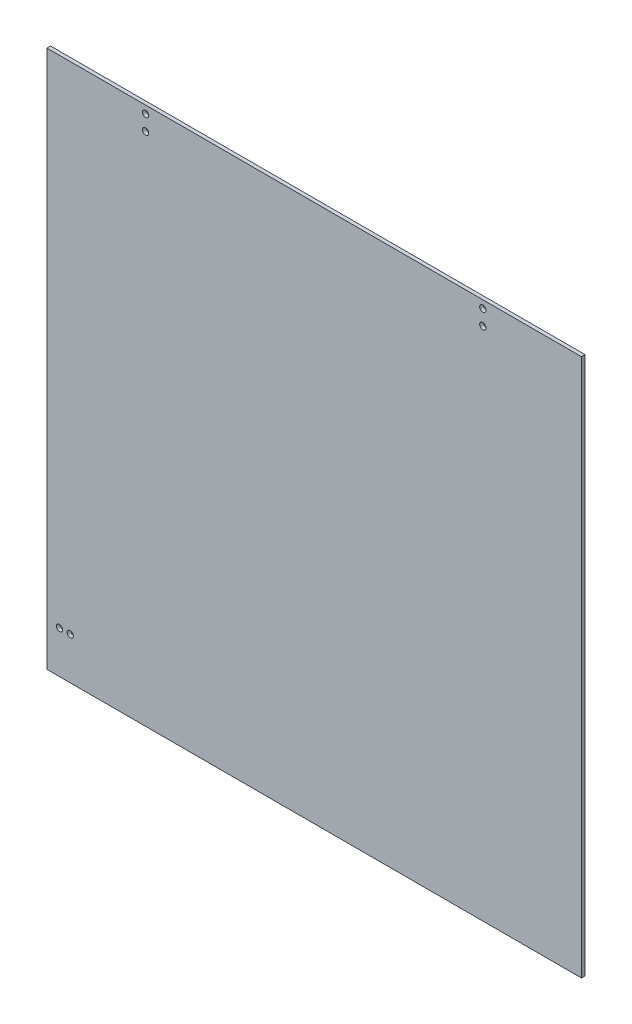
ISO-10303-21;
HEADER;
FILE_DESCRIPTION(('STEP AP214'),'2;1');
FILE_NAME('part.step','',(''),(''),'','','');
FILE_SCHEMA(('AUTOMOTIVE_DESIGN { 1 0 10303 214 1 1 1 1 }'));
ENDSEC;
DATA;
#1=APPLICATION_CONTEXT('core data for automotive mechanical design processes');
#2=APPLICATION_PROTOCOL_DEFINITION('international standard','automotive_design',2000,#1);
#3=PRODUCT_CONTEXT('',#1,'mechanical');
#4=PRODUCT('Part','Part','',(#3));
#5=PRODUCT_RELATED_PRODUCT_CATEGORY('part','',(#4));
#6=PRODUCT_DEFINITION_FORMATION('','',#4);
#7=PRODUCT_DEFINITION_CONTEXT('part definition',#1,'design');
#8=PRODUCT_DEFINITION('design','',#6,#7);
#9=PRODUCT_DEFINITION_SHAPE('','',#8);
#10=(LENGTH_UNIT() NAMED_UNIT(*) SI_UNIT(.MILLI.,.METRE.));
#11=(NAMED_UNIT(*) PLANE_ANGLE_UNIT() SI_UNIT($,.RADIAN.));
#12=(NAMED_UNIT(*) SI_UNIT($,.STERADIAN.) SOLID_ANGLE_UNIT());
#13=UNCERTAINTY_MEASURE_WITH_UNIT(LENGTH_MEASURE(1.E-05),#10,'distance_accuracy_value','');
#14=(GEOMETRIC_REPRESENTATION_CONTEXT(3) GLOBAL_UNCERTAINTY_ASSIGNED_CONTEXT((#13)) GLOBAL_UNIT_ASSIGNED_CONTEXT((#10,
#11,#12)) REPRESENTATION_CONTEXT('',''));
#15=CARTESIAN_POINT('',(0.,0.,0.));
#16=DIRECTION('',(0.,0.,1.));
#17=DIRECTION('',(1.,0.,0.));
#18=AXIS2_PLACEMENT_3D('',#15,#16,#17);
#19=CARTESIAN_POINT('',(0.,0.,2.));
#20=DIRECTION('',(1.,0.,0.));
#21=DIRECTION('',(0.,0.,-1.));
#22=AXIS2_PLACEMENT_3D('',#19,#20,#21);
#23=PLANE('',#22);
#24=DIRECTION('',(0.,-1.,0.));
#25=VECTOR('',#24,1.);
#26=CARTESIAN_POINT('',(0.,0.,0.));
#27=LINE('',#26,#25);
#28=CARTESIAN_POINT('',(0.,300.,0.));
#29=VERTEX_POINT('',#28);
#30=CARTESIAN_POINT('',(0.,0.,0.));
#31=VERTEX_POINT('',#30);
#32=EDGE_CURVE('E98',#29,#31,#27,.T.);
#33=ORIENTED_EDGE('',*,*,#32,.T.);
#34=DIRECTION('',(0.,0.,-1.));
#35=VECTOR('',#34,1.);
#36=CARTESIAN_POINT('',(0.,0.,2.));
#37=LINE('',#36,#35);
#38=CARTESIAN_POINT('',(0.,0.,2.));
#39=VERTEX_POINT('',#38);
#40=EDGE_CURVE('E11',#39,#31,#37,.T.);
#41=ORIENTED_EDGE('',*,*,#40,.F.);
#42=DIRECTION('',(0.,-1.,0.));
#43=VECTOR('',#42,1.);
#44=CARTESIAN_POINT('',(0.,0.,2.));
#45=LINE('',#44,#43);
#46=CARTESIAN_POINT('',(0.,300.,2.));
#47=VERTEX_POINT('',#46);
#48=EDGE_CURVE('E85',#47,#39,#45,.T.);
#49=ORIENTED_EDGE('',*,*,#48,.F.);
#50=DIRECTION('',(0.,0.,-1.));
#51=VECTOR('',#50,1.);
#52=CARTESIAN_POINT('',(0.,300.,2.));
#53=LINE('',#52,#51);
#54=EDGE_CURVE('E94',#47,#29,#53,.T.);
#55=ORIENTED_EDGE('',*,*,#54,.T.);
#56=EDGE_LOOP('',(#33,#41,#49,#55));
#57=FACE_BOUND('',#56,.T.);
#58=ADVANCED_FACE('F32',(#57),#23,.F.);
#59=CARTESIAN_POINT('',(0.,0.,2.));
#60=DIRECTION('',(0.,1.,0.));
#61=DIRECTION('',(0.,0.,1.));
#62=AXIS2_PLACEMENT_3D('',#59,#60,#61);
#63=PLANE('',#62);
#64=DIRECTION('',(1.,0.,0.));
#65=VECTOR('',#64,1.);
#66=CARTESIAN_POINT('',(0.,0.,0.));
#67=LINE('',#66,#65);
#68=CARTESIAN_POINT('',(298.,0.,0.));
#69=VERTEX_POINT('',#68);
#70=EDGE_CURVE('E89',#31,#69,#67,.T.);
#71=ORIENTED_EDGE('',*,*,#70,.T.);
#72=DIRECTION('',(0.,0.,-1.));
#73=VECTOR('',#72,1.);
#74=CARTESIAN_POINT('',(298.,0.,2.));
#75=LINE('',#74,#73);
#76=CARTESIAN_POINT('',(298.,0.,2.));
#77=VERTEX_POINT('',#76);
#78=EDGE_CURVE('E41',#77,#69,#75,.T.);
#79=ORIENTED_EDGE('',*,*,#78,.F.);
#80=DIRECTION('',(1.,0.,0.));
#81=VECTOR('',#80,1.);
#82=CARTESIAN_POINT('',(0.,0.,2.));
#83=LINE('',#82,#81);
#84=EDGE_CURVE('E80',#39,#77,#83,.T.);
#85=ORIENTED_EDGE('',*,*,#84,.F.);
#86=ORIENTED_EDGE('',*,*,#40,.T.);
#87=EDGE_LOOP('',(#71,#79,#85,#86));
#88=FACE_BOUND('',#87,.T.);
#89=ADVANCED_FACE('F88',(#88),#63,.F.);
#90=CARTESIAN_POINT('',(298.,0.,2.));
#91=DIRECTION('',(-1.,0.,0.));
#92=DIRECTION('',(0.,0.,1.));
#93=AXIS2_PLACEMENT_3D('',#90,#91,#92);
#94=PLANE('',#93);
#95=DIRECTION('',(0.,1.,0.));
#96=VECTOR('',#95,1.);
#97=CARTESIAN_POINT('',(298.,0.,0.));
#98=LINE('',#97,#96);
#99=CARTESIAN_POINT('',(298.,300.,0.));
#100=VERTEX_POINT('',#99);
#101=EDGE_CURVE('E67',#69,#100,#98,.T.);
#102=ORIENTED_EDGE('',*,*,#101,.T.);
#103=DIRECTION('',(0.,0.,-1.));
#104=VECTOR('',#103,1.);
#105=CARTESIAN_POINT('',(298.,300.,2.));
#106=LINE('',#105,#104);
#107=CARTESIAN_POINT('',(298.,300.,2.));
#108=VERTEX_POINT('',#107);
#109=EDGE_CURVE('E90',#108,#100,#106,.T.);
#110=ORIENTED_EDGE('',*,*,#109,.F.);
#111=DIRECTION('',(0.,1.,0.));
#112=VECTOR('',#111,1.);
#113=CARTESIAN_POINT('',(298.,0.,2.));
#114=LINE('',#113,#112);
#115=EDGE_CURVE('E83',#77,#108,#114,.T.);
#116=ORIENTED_EDGE('',*,*,#115,.F.);
#117=ORIENTED_EDGE('',*,*,#78,.T.);
#118=EDGE_LOOP('',(#102,#110,#116,#117));
#119=FACE_BOUND('',#118,.T.);
#120=ADVANCED_FACE('F92',(#119),#94,.F.);
#121=CARTESIAN_POINT('',(0.,300.,2.));
#122=DIRECTION('',(0.,-1.,0.));
#123=DIRECTION('',(0.,0.,-1.));
#124=AXIS2_PLACEMENT_3D('',#121,#122,#123);
#125=PLANE('',#124);
#126=DIRECTION('',(-1.,0.,0.));
#127=VECTOR('',#126,1.);
#128=CARTESIAN_POINT('',(0.,300.,0.));
#129=LINE('',#128,#127);
#130=EDGE_CURVE('E73',#100,#29,#129,.T.);
#131=ORIENTED_EDGE('',*,*,#130,.T.);
#132=ORIENTED_EDGE('',*,*,#54,.F.);
#133=DIRECTION('',(-1.,0.,0.));
#134=VECTOR('',#133,1.);
#135=CARTESIAN_POINT('',(0.,300.,2.));
#136=LINE('',#135,#134);
#137=EDGE_CURVE('E50',#108,#47,#136,.T.);
#138=ORIENTED_EDGE('',*,*,#137,.F.);
#139=ORIENTED_EDGE('',*,*,#109,.T.);
#140=EDGE_LOOP('',(#131,#132,#138,#139));
#141=FACE_BOUND('',#140,.T.);
#142=ADVANCED_FACE('F156',(#141),#125,.F.);
#143=CARTESIAN_POINT('',(0.,0.,2.));
#144=DIRECTION('',(0.,0.,-1.));
#145=DIRECTION('',(-1.,0.,0.));
#146=AXIS2_PLACEMENT_3D('',#143,#144,#145);
#147=PLANE('',#146);
#148=CARTESIAN_POINT('',(13.0000000000001,23.4999999999999,2.));
#149=DIRECTION('',(0.,0.,1.));
#150=DIRECTION('',(1.,0.,0.));
#151=AXIS2_PLACEMENT_3D('',#148,#149,#150);
#152=CIRCLE('',#151,1.75);
#153=CARTESIAN_POINT('',(14.7500000000001,23.4999999999999,2.));
#154=VERTEX_POINT('',#153);
#155=EDGE_CURVE('E138',#154,#154,#152,.T.);
#156=ORIENTED_EDGE('',*,*,#155,.F.);
#157=EDGE_LOOP('',(#156));
#158=FACE_BOUND('',#157,.T.);
#159=CARTESIAN_POINT('',(7.0000000000001,23.4999999999999,2.));
#160=DIRECTION('',(0.,0.,1.));
#161=DIRECTION('',(1.,0.,0.));
#162=AXIS2_PLACEMENT_3D('',#159,#160,#161);
#163=CIRCLE('',#162,1.75);
#164=CARTESIAN_POINT('',(8.7500000000001,23.4999999999999,2.));
#165=VERTEX_POINT('',#164);
#166=EDGE_CURVE('E132',#165,#165,#163,.T.);
#167=ORIENTED_EDGE('',*,*,#166,.F.);
#168=EDGE_LOOP('',(#167));
#169=FACE_BOUND('',#168,.T.);
#170=CARTESIAN_POINT('',(55.,295.75,2.));
#171=DIRECTION('',(0.,0.,-1.));
#172=DIRECTION('',(-1.,0.,0.));
#173=AXIS2_PLACEMENT_3D('',#170,#171,#172);
#174=CIRCLE('',#173,1.75);
#175=CARTESIAN_POINT('',(53.25,295.75,2.));
#176=VERTEX_POINT('',#175);
#177=EDGE_CURVE('E125',#176,#176,#174,.T.);
#178=ORIENTED_EDGE('',*,*,#177,.T.);
#179=EDGE_LOOP('',(#178));
#180=FACE_BOUND('',#179,.T.);
#181=CARTESIAN_POINT('',(55.,287.25,2.));
#182=DIRECTION('',(0.,0.,-1.));
#183=DIRECTION('',(-1.,0.,0.));
#184=AXIS2_PLACEMENT_3D('',#181,#182,#183);
#185=CIRCLE('',#184,1.75);
#186=CARTESIAN_POINT('',(53.25,287.25,2.));
#187=VERTEX_POINT('',#186);
#188=EDGE_CURVE('E119',#187,#187,#185,.T.);
#189=ORIENTED_EDGE('',*,*,#188,.T.);
#190=EDGE_LOOP('',(#189));
#191=FACE_BOUND('',#190,.T.);
#192=CARTESIAN_POINT('',(243.,287.25,2.));
#193=DIRECTION('',(0.,0.,1.));
#194=DIRECTION('',(1.,0.,0.));
#195=AXIS2_PLACEMENT_3D('',#192,#193,#194);
#196=CIRCLE('',#195,1.74999999999996);
#197=CARTESIAN_POINT('',(244.75,287.25,2.));
#198=VERTEX_POINT('',#197);
#199=EDGE_CURVE('E115',#198,#198,#196,.T.);
#200=ORIENTED_EDGE('',*,*,#199,.F.);
#201=EDGE_LOOP('',(#200));
#202=FACE_BOUND('',#201,.T.);
#203=CARTESIAN_POINT('',(243.,295.75,2.));
#204=DIRECTION('',(0.,0.,1.));
#205=DIRECTION('',(1.,0.,0.));
#206=AXIS2_PLACEMENT_3D('',#203,#204,#205);
#207=CIRCLE('',#206,1.74999999999996);
#208=CARTESIAN_POINT('',(244.75,295.75,2.));
#209=VERTEX_POINT('',#208);
#210=EDGE_CURVE('E107',#209,#209,#207,.T.);
#211=ORIENTED_EDGE('',*,*,#210,.F.);
#212=EDGE_LOOP('',(#211));
#213=FACE_BOUND('',#212,.T.);
#214=ORIENTED_EDGE('',*,*,#48,.T.);
#215=ORIENTED_EDGE('',*,*,#84,.T.);
#216=ORIENTED_EDGE('',*,*,#115,.T.);
#217=ORIENTED_EDGE('',*,*,#137,.T.);
#218=EDGE_LOOP('',(#214,#215,#216,#217));
#219=FACE_BOUND('',#218,.T.);
#220=ADVANCED_FACE('F81',(#158,#169,#180,#191,#202,#213,#219),#147,.F.);
#221=CARTESIAN_POINT('',(0.,0.,0.));
#222=DIRECTION('',(0.,0.,-1.));
#223=DIRECTION('',(-1.,0.,0.));
#224=AXIS2_PLACEMENT_3D('',#221,#222,#223);
#225=PLANE('',#224);
#226=CARTESIAN_POINT('',(13.0000000000001,23.4999999999999,0.));
#227=DIRECTION('',(0.,0.,1.));
#228=DIRECTION('',(1.,0.,0.));
#229=AXIS2_PLACEMENT_3D('',#226,#227,#228);
#230=CIRCLE('',#229,1.75);
#231=CARTESIAN_POINT('',(14.7500000000001,23.4999999999999,0.));
#232=VERTEX_POINT('',#231);
#233=EDGE_CURVE('E135',#232,#232,#230,.T.);
#234=ORIENTED_EDGE('',*,*,#233,.T.);
#235=EDGE_LOOP('',(#234));
#236=FACE_BOUND('',#235,.T.);
#237=CARTESIAN_POINT('',(7.0000000000001,23.4999999999999,0.));
#238=DIRECTION('',(0.,0.,1.));
#239=DIRECTION('',(1.,0.,0.));
#240=AXIS2_PLACEMENT_3D('',#237,#238,#239);
#241=CIRCLE('',#240,1.75);
#242=CARTESIAN_POINT('',(8.7500000000001,23.4999999999999,0.));
#243=VERTEX_POINT('',#242);
#244=EDGE_CURVE('E131',#243,#243,#241,.T.);
#245=ORIENTED_EDGE('',*,*,#244,.T.);
#246=EDGE_LOOP('',(#245));
#247=FACE_BOUND('',#246,.T.);
#248=CARTESIAN_POINT('',(55.,295.75,0.));
#249=DIRECTION('',(0.,0.,1.));
#250=DIRECTION('',(1.,0.,0.));
#251=AXIS2_PLACEMENT_3D('',#248,#249,#250);
#252=CIRCLE('',#251,1.75);
#253=CARTESIAN_POINT('',(56.75,295.75,0.));
#254=VERTEX_POINT('',#253);
#255=EDGE_CURVE('E128',#254,#254,#252,.T.);
#256=ORIENTED_EDGE('',*,*,#255,.T.);
#257=EDGE_LOOP('',(#256));
#258=FACE_BOUND('',#257,.T.);
#259=CARTESIAN_POINT('',(55.,287.25,0.));
#260=DIRECTION('',(0.,0.,1.));
#261=DIRECTION('',(1.,0.,0.));
#262=AXIS2_PLACEMENT_3D('',#259,#260,#261);
#263=CIRCLE('',#262,1.75);
#264=CARTESIAN_POINT('',(56.75,287.25,0.));
#265=VERTEX_POINT('',#264);
#266=EDGE_CURVE('E122',#265,#265,#263,.T.);
#267=ORIENTED_EDGE('',*,*,#266,.T.);
#268=EDGE_LOOP('',(#267));
#269=FACE_BOUND('',#268,.T.);
#270=CARTESIAN_POINT('',(243.,287.25,0.));
#271=DIRECTION('',(0.,0.,-1.));
#272=DIRECTION('',(-1.,0.,0.));
#273=AXIS2_PLACEMENT_3D('',#270,#271,#272);
#274=CIRCLE('',#273,1.74999999999996);
#275=CARTESIAN_POINT('',(241.25,287.25,0.));
#276=VERTEX_POINT('',#275);
#277=EDGE_CURVE('E35',#276,#276,#274,.T.);
#278=ORIENTED_EDGE('',*,*,#277,.F.);
#279=EDGE_LOOP('',(#278));
#280=FACE_BOUND('',#279,.T.);
#281=CARTESIAN_POINT('',(243.,295.75,0.));
#282=DIRECTION('',(0.,0.,-1.));
#283=DIRECTION('',(-1.,0.,0.));
#284=AXIS2_PLACEMENT_3D('',#281,#282,#283);
#285=CIRCLE('',#284,1.74999999999996);
#286=CARTESIAN_POINT('',(241.25,295.75,0.));
#287=VERTEX_POINT('',#286);
#288=EDGE_CURVE('E101',#287,#287,#285,.T.);
#289=ORIENTED_EDGE('',*,*,#288,.F.);
#290=EDGE_LOOP('',(#289));
#291=FACE_BOUND('',#290,.T.);
#292=ORIENTED_EDGE('',*,*,#32,.F.);
#293=ORIENTED_EDGE('',*,*,#130,.F.);
#294=ORIENTED_EDGE('',*,*,#101,.F.);
#295=ORIENTED_EDGE('',*,*,#70,.F.);
#296=EDGE_LOOP('',(#292,#293,#294,#295));
#297=FACE_BOUND('',#296,.T.);
#298=ADVANCED_FACE('F144',(#236,#247,#258,#269,#280,#291,#297),#225,.T.);
#299=CARTESIAN_POINT('',(243.,295.75,-18.));
#300=DIRECTION('',(0.,0.,1.));
#301=DIRECTION('',(1.,0.,0.));
#302=AXIS2_PLACEMENT_3D('',#299,#300,#301);
#303=CYLINDRICAL_SURFACE('',#302,1.74999999999996);
#304=ORIENTED_EDGE('',*,*,#288,.T.);
#305=EDGE_LOOP('',(#304));
#306=FACE_BOUND('',#305,.T.);
#307=ORIENTED_EDGE('',*,*,#210,.T.);
#308=EDGE_LOOP('',(#307));
#309=FACE_BOUND('',#308,.T.);
#310=ADVANCED_FACE('F170',(#306,#309),#303,.F.);
#311=CARTESIAN_POINT('',(243.,287.25,-18.));
#312=DIRECTION('',(0.,0.,1.));
#313=DIRECTION('',(1.,0.,0.));
#314=AXIS2_PLACEMENT_3D('',#311,#312,#313);
#315=CYLINDRICAL_SURFACE('',#314,1.74999999999996);
#316=ORIENTED_EDGE('',*,*,#277,.T.);
#317=EDGE_LOOP('',(#316));
#318=FACE_BOUND('',#317,.T.);
#319=ORIENTED_EDGE('',*,*,#199,.T.);
#320=EDGE_LOOP('',(#319));
#321=FACE_BOUND('',#320,.T.);
#322=ADVANCED_FACE('F167',(#318,#321),#315,.F.);
#323=CARTESIAN_POINT('',(55.,287.25,0.));
#324=DIRECTION('',(0.,0.,1.));
#325=DIRECTION('',(1.,0.,0.));
#326=AXIS2_PLACEMENT_3D('',#323,#324,#325);
#327=CYLINDRICAL_SURFACE('',#326,1.75);
#328=ORIENTED_EDGE('',*,*,#266,.F.);
#329=EDGE_LOOP('',(#328));
#330=FACE_BOUND('',#329,.T.);
#331=ORIENTED_EDGE('',*,*,#188,.F.);
#332=EDGE_LOOP('',(#331));
#333=FACE_BOUND('',#332,.T.);
#334=ADVANCED_FACE('F169',(#330,#333),#327,.F.);
#335=CARTESIAN_POINT('',(55.,295.75,0.));
#336=DIRECTION('',(0.,0.,1.));
#337=DIRECTION('',(1.,0.,0.));
#338=AXIS2_PLACEMENT_3D('',#335,#336,#337);
#339=CYLINDRICAL_SURFACE('',#338,1.75);
#340=ORIENTED_EDGE('',*,*,#255,.F.);
#341=EDGE_LOOP('',(#340));
#342=FACE_BOUND('',#341,.T.);
#343=ORIENTED_EDGE('',*,*,#177,.F.);
#344=EDGE_LOOP('',(#343));
#345=FACE_BOUND('',#344,.T.);
#346=ADVANCED_FACE('F177',(#342,#345),#339,.F.);
#347=CARTESIAN_POINT('',(7.0000000000001,23.4999999999999,0.));
#348=DIRECTION('',(0.,0.,1.));
#349=DIRECTION('',(1.,0.,0.));
#350=AXIS2_PLACEMENT_3D('',#347,#348,#349);
#351=CYLINDRICAL_SURFACE('',#350,1.75);
#352=ORIENTED_EDGE('',*,*,#244,.F.);
#353=EDGE_LOOP('',(#352));
#354=FACE_BOUND('',#353,.T.);
#355=ORIENTED_EDGE('',*,*,#166,.T.);
#356=EDGE_LOOP('',(#355));
#357=FACE_BOUND('',#356,.T.);
#358=ADVANCED_FACE('F150',(#354,#357),#351,.F.);
#359=CARTESIAN_POINT('',(13.0000000000001,23.4999999999999,0.));
#360=DIRECTION('',(0.,0.,1.));
#361=DIRECTION('',(1.,0.,0.));
#362=AXIS2_PLACEMENT_3D('',#359,#360,#361);
#363=CYLINDRICAL_SURFACE('',#362,1.75);
#364=ORIENTED_EDGE('',*,*,#233,.F.);
#365=EDGE_LOOP('',(#364));
#366=FACE_BOUND('',#365,.T.);
#367=ORIENTED_EDGE('',*,*,#155,.T.);
#368=EDGE_LOOP('',(#367));
#369=FACE_BOUND('',#368,.T.);
#370=ADVANCED_FACE('F147',(#366,#369),#363,.F.);
#371=CLOSED_SHELL('',(#58,#89,#120,#142,#220,#298,#310,#322,#334,#346,#358,#370));
#372=MANIFOLD_SOLID_BREP('B2',#371);
#373=ADVANCED_BREP_SHAPE_REPRESENTATION('',(#18,#372),#14);
#374=SHAPE_DEFINITION_REPRESENTATION(#9,#373);
ENDSEC;
END-ISO-10303-21;
